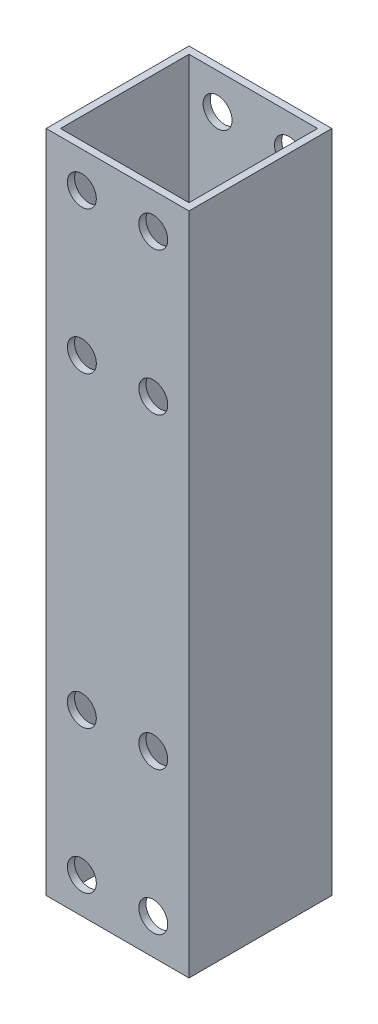
ISO-10303-21;
HEADER;
FILE_DESCRIPTION(('STEP AP214'),'2;1');
FILE_NAME('part.step','',(''),(''),'','','');
FILE_SCHEMA(('AUTOMOTIVE_DESIGN { 1 0 10303 214 1 1 1 1 }'));
ENDSEC;
DATA;
#1=APPLICATION_CONTEXT('core data for automotive mechanical design processes');
#2=APPLICATION_PROTOCOL_DEFINITION('international standard','automotive_design',2000,#1);
#3=PRODUCT_CONTEXT('',#1,'mechanical');
#4=PRODUCT('Part','Part','',(#3));
#5=PRODUCT_RELATED_PRODUCT_CATEGORY('part','',(#4));
#6=PRODUCT_DEFINITION_FORMATION('','',#4);
#7=PRODUCT_DEFINITION_CONTEXT('part definition',#1,'design');
#8=PRODUCT_DEFINITION('design','',#6,#7);
#9=PRODUCT_DEFINITION_SHAPE('','',#8);
#10=(LENGTH_UNIT() NAMED_UNIT(*) SI_UNIT(.MILLI.,.METRE.));
#11=(NAMED_UNIT(*) PLANE_ANGLE_UNIT() SI_UNIT($,.RADIAN.));
#12=(NAMED_UNIT(*) SI_UNIT($,.STERADIAN.) SOLID_ANGLE_UNIT());
#13=UNCERTAINTY_MEASURE_WITH_UNIT(LENGTH_MEASURE(1.E-05),#10,'distance_accuracy_value','');
#14=(GEOMETRIC_REPRESENTATION_CONTEXT(3) GLOBAL_UNCERTAINTY_ASSIGNED_CONTEXT((#13)) GLOBAL_UNIT_ASSIGNED_CONTEXT((#10,
#11,#12)) REPRESENTATION_CONTEXT('',''));
#15=CARTESIAN_POINT('',(0.,0.,0.));
#16=DIRECTION('',(0.,0.,1.));
#17=DIRECTION('',(1.,0.,0.));
#18=AXIS2_PLACEMENT_3D('',#15,#16,#17);
#19=CARTESIAN_POINT('',(0.,93.,0.));
#20=DIRECTION('',(0.,1.,0.));
#21=DIRECTION('',(0.,0.,1.));
#22=AXIS2_PLACEMENT_3D('',#19,#20,#21);
#23=PLANE('',#22);
#24=DIRECTION('',(0.,0.,-1.));
#25=VECTOR('',#24,1.);
#26=CARTESIAN_POINT('',(10.,93.,-10.));
#27=LINE('',#26,#25);
#28=CARTESIAN_POINT('',(10.,93.,10.));
#29=VERTEX_POINT('',#28);
#30=CARTESIAN_POINT('',(10.,93.,-10.));
#31=VERTEX_POINT('',#30);
#32=EDGE_CURVE('E139',#29,#31,#27,.T.);
#33=ORIENTED_EDGE('',*,*,#32,.T.);
#34=DIRECTION('',(-1.,0.,0.));
#35=VECTOR('',#34,1.);
#36=CARTESIAN_POINT('',(-10.,93.,-10.));
#37=LINE('',#36,#35);
#38=CARTESIAN_POINT('',(-10.,93.,-10.));
#39=VERTEX_POINT('',#38);
#40=EDGE_CURVE('E142',#31,#39,#37,.T.);
#41=ORIENTED_EDGE('',*,*,#40,.T.);
#42=DIRECTION('',(0.,0.,1.));
#43=VECTOR('',#42,1.);
#44=CARTESIAN_POINT('',(-10.,93.,-10.));
#45=LINE('',#44,#43);
#46=CARTESIAN_POINT('',(-10.,93.,10.));
#47=VERTEX_POINT('',#46);
#48=EDGE_CURVE('E145',#39,#47,#45,.T.);
#49=ORIENTED_EDGE('',*,*,#48,.T.);
#50=DIRECTION('',(1.,0.,0.));
#51=VECTOR('',#50,1.);
#52=CARTESIAN_POINT('',(-10.,93.,10.));
#53=LINE('',#52,#51);
#54=EDGE_CURVE('E147',#47,#29,#53,.T.);
#55=ORIENTED_EDGE('',*,*,#54,.T.);
#56=EDGE_LOOP('',(#33,#41,#49,#55));
#57=FACE_BOUND('',#56,.T.);
#58=DIRECTION('',(1.,0.,0.));
#59=VECTOR('',#58,1.);
#60=CARTESIAN_POINT('',(-9.,93.,9.));
#61=LINE('',#60,#59);
#62=CARTESIAN_POINT('',(-9.,93.,9.));
#63=VERTEX_POINT('',#62);
#64=CARTESIAN_POINT('',(9.00000000000001,93.,9.));
#65=VERTEX_POINT('',#64);
#66=EDGE_CURVE('E109',#63,#65,#61,.T.);
#67=ORIENTED_EDGE('',*,*,#66,.F.);
#68=DIRECTION('',(0.,0.,1.));
#69=VECTOR('',#68,1.);
#70=CARTESIAN_POINT('',(-9.00000000000001,93.,-9.));
#71=LINE('',#70,#69);
#72=CARTESIAN_POINT('',(-9.00000000000001,93.,-9.));
#73=VERTEX_POINT('',#72);
#74=EDGE_CURVE('E101',#73,#63,#71,.T.);
#75=ORIENTED_EDGE('',*,*,#74,.F.);
#76=DIRECTION('',(-1.,0.,0.));
#77=VECTOR('',#76,1.);
#78=CARTESIAN_POINT('',(-9.00000000000001,93.,-9.));
#79=LINE('',#78,#77);
#80=CARTESIAN_POINT('',(9.00000000000001,93.,-9.));
#81=VERTEX_POINT('',#80);
#82=EDGE_CURVE('E123',#81,#73,#79,.T.);
#83=ORIENTED_EDGE('',*,*,#82,.F.);
#84=DIRECTION('',(0.,0.,-1.));
#85=VECTOR('',#84,1.);
#86=CARTESIAN_POINT('',(9.00000000000001,93.,-9.));
#87=LINE('',#86,#85);
#88=EDGE_CURVE('E121',#65,#81,#87,.T.);
#89=ORIENTED_EDGE('',*,*,#88,.F.);
#90=EDGE_LOOP('',(#67,#75,#83,#89));
#91=FACE_BOUND('',#90,.T.);
#92=ADVANCED_FACE('F34',(#57,#91),#23,.T.);
#93=CARTESIAN_POINT('',(0.,0.,0.));
#94=DIRECTION('',(0.,1.,0.));
#95=DIRECTION('',(0.,0.,1.));
#96=AXIS2_PLACEMENT_3D('',#93,#94,#95);
#97=PLANE('',#96);
#98=DIRECTION('',(0.,0.,-1.));
#99=VECTOR('',#98,1.);
#100=CARTESIAN_POINT('',(10.,0.,-10.));
#101=LINE('',#100,#99);
#102=CARTESIAN_POINT('',(10.,0.,10.));
#103=VERTEX_POINT('',#102);
#104=CARTESIAN_POINT('',(10.,0.,-10.));
#105=VERTEX_POINT('',#104);
#106=EDGE_CURVE('E117',#103,#105,#101,.T.);
#107=ORIENTED_EDGE('',*,*,#106,.F.);
#108=DIRECTION('',(1.,0.,0.));
#109=VECTOR('',#108,1.);
#110=CARTESIAN_POINT('',(-10.,0.,10.));
#111=LINE('',#110,#109);
#112=CARTESIAN_POINT('',(-10.,0.,10.));
#113=VERTEX_POINT('',#112);
#114=EDGE_CURVE('E143',#113,#103,#111,.T.);
#115=ORIENTED_EDGE('',*,*,#114,.F.);
#116=DIRECTION('',(0.,0.,1.));
#117=VECTOR('',#116,1.);
#118=CARTESIAN_POINT('',(-10.,0.,-10.));
#119=LINE('',#118,#117);
#120=CARTESIAN_POINT('',(-10.,0.,-10.));
#121=VERTEX_POINT('',#120);
#122=EDGE_CURVE('E154',#121,#113,#119,.T.);
#123=ORIENTED_EDGE('',*,*,#122,.F.);
#124=DIRECTION('',(-1.,0.,0.));
#125=VECTOR('',#124,1.);
#126=CARTESIAN_POINT('',(-10.,0.,-10.));
#127=LINE('',#126,#125);
#128=EDGE_CURVE('E152',#105,#121,#127,.T.);
#129=ORIENTED_EDGE('',*,*,#128,.F.);
#130=EDGE_LOOP('',(#107,#115,#123,#129));
#131=FACE_BOUND('',#130,.T.);
#132=DIRECTION('',(0.,0.,1.));
#133=VECTOR('',#132,1.);
#134=CARTESIAN_POINT('',(-9.00000000000001,0.,-9.));
#135=LINE('',#134,#133);
#136=CARTESIAN_POINT('',(-9.00000000000001,0.,-9.));
#137=VERTEX_POINT('',#136);
#138=CARTESIAN_POINT('',(-9.,0.,9.));
#139=VERTEX_POINT('',#138);
#140=EDGE_CURVE('E59',#137,#139,#135,.T.);
#141=ORIENTED_EDGE('',*,*,#140,.T.);
#142=DIRECTION('',(1.,0.,0.));
#143=VECTOR('',#142,1.);
#144=CARTESIAN_POINT('',(-9.,0.,9.));
#145=LINE('',#144,#143);
#146=CARTESIAN_POINT('',(9.00000000000001,0.,9.));
#147=VERTEX_POINT('',#146);
#148=EDGE_CURVE('E116',#139,#147,#145,.T.);
#149=ORIENTED_EDGE('',*,*,#148,.T.);
#150=DIRECTION('',(0.,0.,-1.));
#151=VECTOR('',#150,1.);
#152=CARTESIAN_POINT('',(9.00000000000001,0.,-9.));
#153=LINE('',#152,#151);
#154=CARTESIAN_POINT('',(9.00000000000001,0.,-9.));
#155=VERTEX_POINT('',#154);
#156=EDGE_CURVE('E131',#147,#155,#153,.T.);
#157=ORIENTED_EDGE('',*,*,#156,.T.);
#158=DIRECTION('',(-1.,0.,0.));
#159=VECTOR('',#158,1.);
#160=CARTESIAN_POINT('',(-9.00000000000001,0.,-9.));
#161=LINE('',#160,#159);
#162=EDGE_CURVE('E110',#155,#137,#161,.T.);
#163=ORIENTED_EDGE('',*,*,#162,.T.);
#164=EDGE_LOOP('',(#141,#149,#157,#163));
#165=FACE_BOUND('',#164,.T.);
#166=ADVANCED_FACE('F230',(#131,#165),#97,.F.);
#167=CARTESIAN_POINT('',(10.,93.,-10.));
#168=DIRECTION('',(-1.,0.,0.));
#169=DIRECTION('',(0.,0.,1.));
#170=AXIS2_PLACEMENT_3D('',#167,#168,#169);
#171=PLANE('',#170);
#172=ORIENTED_EDGE('',*,*,#106,.T.);
#173=DIRECTION('',(0.,-1.,0.));
#174=VECTOR('',#173,1.);
#175=CARTESIAN_POINT('',(10.,93.,-10.));
#176=LINE('',#175,#174);
#177=EDGE_CURVE('E11',#31,#105,#176,.T.);
#178=ORIENTED_EDGE('',*,*,#177,.F.);
#179=ORIENTED_EDGE('',*,*,#32,.F.);
#180=DIRECTION('',(0.,-1.,0.));
#181=VECTOR('',#180,1.);
#182=CARTESIAN_POINT('',(10.,93.,10.));
#183=LINE('',#182,#181);
#184=EDGE_CURVE('E149',#29,#103,#183,.T.);
#185=ORIENTED_EDGE('',*,*,#184,.T.);
#186=EDGE_LOOP('',(#172,#178,#179,#185));
#187=FACE_BOUND('',#186,.T.);
#188=ADVANCED_FACE('F36',(#187),#171,.F.);
#189=CARTESIAN_POINT('',(-10.,93.,-10.));
#190=DIRECTION('',(0.,0.,1.));
#191=DIRECTION('',(1.,0.,0.));
#192=AXIS2_PLACEMENT_3D('',#189,#190,#191);
#193=PLANE('',#192);
#194=CARTESIAN_POINT('',(5.,88.,-10.));
#195=DIRECTION('',(0.,0.,1.));
#196=DIRECTION('',(1.,0.,0.));
#197=AXIS2_PLACEMENT_3D('',#194,#195,#196);
#198=CIRCLE('',#197,2.025);
#199=CARTESIAN_POINT('',(7.025,88.,-10.));
#200=VERTEX_POINT('',#199);
#201=EDGE_CURVE('E266',#200,#200,#198,.T.);
#202=ORIENTED_EDGE('',*,*,#201,.T.);
#203=EDGE_LOOP('',(#202));
#204=FACE_BOUND('',#203,.T.);
#205=CARTESIAN_POINT('',(5.,4.99999999999999,-10.));
#206=DIRECTION('',(0.,0.,1.));
#207=DIRECTION('',(1.,0.,0.));
#208=AXIS2_PLACEMENT_3D('',#205,#206,#207);
#209=CIRCLE('',#208,2.025);
#210=CARTESIAN_POINT('',(7.025,4.99999999999999,-10.));
#211=VERTEX_POINT('',#210);
#212=EDGE_CURVE('E270',#211,#211,#209,.T.);
#213=ORIENTED_EDGE('',*,*,#212,.T.);
#214=EDGE_LOOP('',(#213));
#215=FACE_BOUND('',#214,.T.);
#216=CARTESIAN_POINT('',(5.,25.,-10.));
#217=DIRECTION('',(0.,0.,1.));
#218=DIRECTION('',(1.,0.,0.));
#219=AXIS2_PLACEMENT_3D('',#216,#217,#218);
#220=CIRCLE('',#219,2.025);
#221=CARTESIAN_POINT('',(7.025,25.,-10.));
#222=VERTEX_POINT('',#221);
#223=EDGE_CURVE('E274',#222,#222,#220,.T.);
#224=ORIENTED_EDGE('',*,*,#223,.T.);
#225=EDGE_LOOP('',(#224));
#226=FACE_BOUND('',#225,.T.);
#227=CARTESIAN_POINT('',(-5.,25.,-10.));
#228=DIRECTION('',(0.,0.,1.));
#229=DIRECTION('',(1.,0.,0.));
#230=AXIS2_PLACEMENT_3D('',#227,#228,#229);
#231=CIRCLE('',#230,2.025);
#232=CARTESIAN_POINT('',(-2.975,25.,-10.));
#233=VERTEX_POINT('',#232);
#234=EDGE_CURVE('E278',#233,#233,#231,.T.);
#235=ORIENTED_EDGE('',*,*,#234,.T.);
#236=EDGE_LOOP('',(#235));
#237=FACE_BOUND('',#236,.T.);
#238=CARTESIAN_POINT('',(5.,68.,-10.));
#239=DIRECTION('',(0.,0.,1.));
#240=DIRECTION('',(1.,0.,0.));
#241=AXIS2_PLACEMENT_3D('',#238,#239,#240);
#242=CIRCLE('',#241,2.025);
#243=CARTESIAN_POINT('',(7.025,68.,-10.));
#244=VERTEX_POINT('',#243);
#245=EDGE_CURVE('E282',#244,#244,#242,.T.);
#246=ORIENTED_EDGE('',*,*,#245,.T.);
#247=EDGE_LOOP('',(#246));
#248=FACE_BOUND('',#247,.T.);
#249=CARTESIAN_POINT('',(-5.,68.,-10.));
#250=DIRECTION('',(0.,0.,1.));
#251=DIRECTION('',(1.,0.,0.));
#252=AXIS2_PLACEMENT_3D('',#249,#250,#251);
#253=CIRCLE('',#252,2.025);
#254=CARTESIAN_POINT('',(-2.975,68.,-10.));
#255=VERTEX_POINT('',#254);
#256=EDGE_CURVE('E286',#255,#255,#253,.T.);
#257=ORIENTED_EDGE('',*,*,#256,.T.);
#258=EDGE_LOOP('',(#257));
#259=FACE_BOUND('',#258,.T.);
#260=CARTESIAN_POINT('',(-5.,88.,-10.));
#261=DIRECTION('',(0.,0.,1.));
#262=DIRECTION('',(1.,0.,0.));
#263=AXIS2_PLACEMENT_3D('',#260,#261,#262);
#264=CIRCLE('',#263,2.025);
#265=CARTESIAN_POINT('',(-2.975,88.,-10.));
#266=VERTEX_POINT('',#265);
#267=EDGE_CURVE('E290',#266,#266,#264,.T.);
#268=ORIENTED_EDGE('',*,*,#267,.T.);
#269=EDGE_LOOP('',(#268));
#270=FACE_BOUND('',#269,.T.);
#271=CARTESIAN_POINT('',(-5.,5.,-10.));
#272=DIRECTION('',(0.,0.,1.));
#273=DIRECTION('',(1.,0.,0.));
#274=AXIS2_PLACEMENT_3D('',#271,#272,#273);
#275=CIRCLE('',#274,2.025);
#276=CARTESIAN_POINT('',(-2.975,5.,-10.));
#277=VERTEX_POINT('',#276);
#278=EDGE_CURVE('E168',#277,#277,#275,.T.);
#279=ORIENTED_EDGE('',*,*,#278,.T.);
#280=EDGE_LOOP('',(#279));
#281=FACE_BOUND('',#280,.T.);
#282=ORIENTED_EDGE('',*,*,#128,.T.);
#283=DIRECTION('',(0.,-1.,0.));
#284=VECTOR('',#283,1.);
#285=CARTESIAN_POINT('',(-10.,93.,-10.));
#286=LINE('',#285,#284);
#287=EDGE_CURVE('E43',#39,#121,#286,.T.);
#288=ORIENTED_EDGE('',*,*,#287,.F.);
#289=ORIENTED_EDGE('',*,*,#40,.F.);
#290=ORIENTED_EDGE('',*,*,#177,.T.);
#291=EDGE_LOOP('',(#282,#288,#289,#290));
#292=FACE_BOUND('',#291,.T.);
#293=ADVANCED_FACE('F255',(#204,#215,#226,#237,#248,#259,#270,#281,#292),#193,.F.);
#294=CARTESIAN_POINT('',(-10.,93.,-10.));
#295=DIRECTION('',(1.,0.,0.));
#296=DIRECTION('',(0.,0.,-1.));
#297=AXIS2_PLACEMENT_3D('',#294,#295,#296);
#298=PLANE('',#297);
#299=ORIENTED_EDGE('',*,*,#122,.T.);
#300=DIRECTION('',(0.,-1.,0.));
#301=VECTOR('',#300,1.);
#302=CARTESIAN_POINT('',(-10.,93.,10.));
#303=LINE('',#302,#301);
#304=EDGE_CURVE('E159',#47,#113,#303,.T.);
#305=ORIENTED_EDGE('',*,*,#304,.F.);
#306=ORIENTED_EDGE('',*,*,#48,.F.);
#307=ORIENTED_EDGE('',*,*,#287,.T.);
#308=EDGE_LOOP('',(#299,#305,#306,#307));
#309=FACE_BOUND('',#308,.T.);
#310=ADVANCED_FACE('F252',(#309),#298,.F.);
#311=CARTESIAN_POINT('',(-10.,93.,10.));
#312=DIRECTION('',(0.,0.,-1.));
#313=DIRECTION('',(-1.,0.,0.));
#314=AXIS2_PLACEMENT_3D('',#311,#312,#313);
#315=PLANE('',#314);
#316=CARTESIAN_POINT('',(5.,88.,10.));
#317=DIRECTION('',(0.,0.,1.));
#318=DIRECTION('',(1.,0.,0.));
#319=AXIS2_PLACEMENT_3D('',#316,#317,#318);
#320=CIRCLE('',#319,2.025);
#321=CARTESIAN_POINT('',(7.025,88.,10.));
#322=VERTEX_POINT('',#321);
#323=EDGE_CURVE('E402',#322,#322,#320,.T.);
#324=ORIENTED_EDGE('',*,*,#323,.F.);
#325=EDGE_LOOP('',(#324));
#326=FACE_BOUND('',#325,.T.);
#327=CARTESIAN_POINT('',(5.,4.99999999999999,10.));
#328=DIRECTION('',(0.,0.,1.));
#329=DIRECTION('',(1.,0.,0.));
#330=AXIS2_PLACEMENT_3D('',#327,#328,#329);
#331=CIRCLE('',#330,2.025);
#332=CARTESIAN_POINT('',(7.025,4.99999999999999,10.));
#333=VERTEX_POINT('',#332);
#334=EDGE_CURVE('E393',#333,#333,#331,.T.);
#335=ORIENTED_EDGE('',*,*,#334,.F.);
#336=EDGE_LOOP('',(#335));
#337=FACE_BOUND('',#336,.T.);
#338=CARTESIAN_POINT('',(5.,25.,10.));
#339=DIRECTION('',(0.,0.,1.));
#340=DIRECTION('',(1.,0.,0.));
#341=AXIS2_PLACEMENT_3D('',#338,#339,#340);
#342=CIRCLE('',#341,2.025);
#343=CARTESIAN_POINT('',(7.025,25.,10.));
#344=VERTEX_POINT('',#343);
#345=EDGE_CURVE('E311',#344,#344,#342,.T.);
#346=ORIENTED_EDGE('',*,*,#345,.F.);
#347=EDGE_LOOP('',(#346));
#348=FACE_BOUND('',#347,.T.);
#349=CARTESIAN_POINT('',(-5.,25.,10.));
#350=DIRECTION('',(0.,0.,1.));
#351=DIRECTION('',(1.,0.,0.));
#352=AXIS2_PLACEMENT_3D('',#349,#350,#351);
#353=CIRCLE('',#352,2.025);
#354=CARTESIAN_POINT('',(-2.975,25.,10.));
#355=VERTEX_POINT('',#354);
#356=EDGE_CURVE('E392',#355,#355,#353,.T.);
#357=ORIENTED_EDGE('',*,*,#356,.F.);
#358=EDGE_LOOP('',(#357));
#359=FACE_BOUND('',#358,.T.);
#360=CARTESIAN_POINT('',(5.,68.,10.));
#361=DIRECTION('',(0.,0.,1.));
#362=DIRECTION('',(1.,0.,0.));
#363=AXIS2_PLACEMENT_3D('',#360,#361,#362);
#364=CIRCLE('',#363,2.025);
#365=CARTESIAN_POINT('',(7.025,68.,10.));
#366=VERTEX_POINT('',#365);
#367=EDGE_CURVE('E414',#366,#366,#364,.T.);
#368=ORIENTED_EDGE('',*,*,#367,.F.);
#369=EDGE_LOOP('',(#368));
#370=FACE_BOUND('',#369,.T.);
#371=CARTESIAN_POINT('',(-5.,68.,10.));
#372=DIRECTION('',(0.,0.,1.));
#373=DIRECTION('',(1.,0.,0.));
#374=AXIS2_PLACEMENT_3D('',#371,#372,#373);
#375=CIRCLE('',#374,2.025);
#376=CARTESIAN_POINT('',(-2.975,68.,10.));
#377=VERTEX_POINT('',#376);
#378=EDGE_CURVE('E418',#377,#377,#375,.T.);
#379=ORIENTED_EDGE('',*,*,#378,.F.);
#380=EDGE_LOOP('',(#379));
#381=FACE_BOUND('',#380,.T.);
#382=CARTESIAN_POINT('',(-5.,88.,10.));
#383=DIRECTION('',(0.,0.,1.));
#384=DIRECTION('',(1.,0.,0.));
#385=AXIS2_PLACEMENT_3D('',#382,#383,#384);
#386=CIRCLE('',#385,2.025);
#387=CARTESIAN_POINT('',(-2.975,88.,10.));
#388=VERTEX_POINT('',#387);
#389=EDGE_CURVE('E398',#388,#388,#386,.T.);
#390=ORIENTED_EDGE('',*,*,#389,.F.);
#391=EDGE_LOOP('',(#390));
#392=FACE_BOUND('',#391,.T.);
#393=CARTESIAN_POINT('',(-5.,5.,10.));
#394=DIRECTION('',(0.,0.,1.));
#395=DIRECTION('',(1.,0.,0.));
#396=AXIS2_PLACEMENT_3D('',#393,#394,#395);
#397=CIRCLE('',#396,2.025);
#398=CARTESIAN_POINT('',(-2.975,5.,10.));
#399=VERTEX_POINT('',#398);
#400=EDGE_CURVE('E306',#399,#399,#397,.T.);
#401=ORIENTED_EDGE('',*,*,#400,.F.);
#402=EDGE_LOOP('',(#401));
#403=FACE_BOUND('',#402,.T.);
#404=ORIENTED_EDGE('',*,*,#114,.T.);
#405=ORIENTED_EDGE('',*,*,#184,.F.);
#406=ORIENTED_EDGE('',*,*,#54,.F.);
#407=ORIENTED_EDGE('',*,*,#304,.T.);
#408=EDGE_LOOP('',(#404,#405,#406,#407));
#409=FACE_BOUND('',#408,.T.);
#410=ADVANCED_FACE('F249',(#326,#337,#348,#359,#370,#381,#392,#403,#409),#315,.F.);
#411=CARTESIAN_POINT('',(-9.00000000000001,93.,-9.));
#412=DIRECTION('',(1.,0.,0.));
#413=DIRECTION('',(0.,0.,-1.));
#414=AXIS2_PLACEMENT_3D('',#411,#412,#413);
#415=PLANE('',#414);
#416=ORIENTED_EDGE('',*,*,#140,.F.);
#417=DIRECTION('',(0.,-1.,0.));
#418=VECTOR('',#417,1.);
#419=CARTESIAN_POINT('',(-9.00000000000001,93.,-9.));
#420=LINE('',#419,#418);
#421=EDGE_CURVE('E105',#73,#137,#420,.T.);
#422=ORIENTED_EDGE('',*,*,#421,.F.);
#423=ORIENTED_EDGE('',*,*,#74,.T.);
#424=DIRECTION('',(0.,-1.,0.));
#425=VECTOR('',#424,1.);
#426=CARTESIAN_POINT('',(-9.,93.,9.));
#427=LINE('',#426,#425);
#428=EDGE_CURVE('E104',#63,#139,#427,.T.);
#429=ORIENTED_EDGE('',*,*,#428,.T.);
#430=EDGE_LOOP('',(#416,#422,#423,#429));
#431=FACE_BOUND('',#430,.T.);
#432=ADVANCED_FACE('F103',(#431),#415,.T.);
#433=CARTESIAN_POINT('',(-9.,93.,9.));
#434=DIRECTION('',(0.,0.,-1.));
#435=DIRECTION('',(-1.,0.,0.));
#436=AXIS2_PLACEMENT_3D('',#433,#434,#435);
#437=PLANE('',#436);
#438=CARTESIAN_POINT('',(5.,88.,9.));
#439=DIRECTION('',(0.,0.,-1.));
#440=DIRECTION('',(-1.,0.,0.));
#441=AXIS2_PLACEMENT_3D('',#438,#439,#440);
#442=CIRCLE('',#441,2.025);
#443=CARTESIAN_POINT('',(2.975,88.,9.));
#444=VERTEX_POINT('',#443);
#445=EDGE_CURVE('E129',#444,#444,#442,.T.);
#446=ORIENTED_EDGE('',*,*,#445,.F.);
#447=EDGE_LOOP('',(#446));
#448=FACE_BOUND('',#447,.T.);
#449=CARTESIAN_POINT('',(5.,4.99999999999999,9.));
#450=DIRECTION('',(0.,0.,-1.));
#451=DIRECTION('',(-1.,0.,0.));
#452=AXIS2_PLACEMENT_3D('',#449,#450,#451);
#453=CIRCLE('',#452,2.025);
#454=CARTESIAN_POINT('',(2.975,4.99999999999999,9.));
#455=VERTEX_POINT('',#454);
#456=EDGE_CURVE('E190',#455,#455,#453,.T.);
#457=ORIENTED_EDGE('',*,*,#456,.F.);
#458=EDGE_LOOP('',(#457));
#459=FACE_BOUND('',#458,.T.);
#460=CARTESIAN_POINT('',(5.,25.,9.));
#461=DIRECTION('',(0.,0.,-1.));
#462=DIRECTION('',(-1.,0.,0.));
#463=AXIS2_PLACEMENT_3D('',#460,#461,#462);
#464=CIRCLE('',#463,2.025);
#465=CARTESIAN_POINT('',(2.975,25.,9.));
#466=VERTEX_POINT('',#465);
#467=EDGE_CURVE('E187',#466,#466,#464,.T.);
#468=ORIENTED_EDGE('',*,*,#467,.F.);
#469=EDGE_LOOP('',(#468));
#470=FACE_BOUND('',#469,.T.);
#471=CARTESIAN_POINT('',(-5.,25.,9.));
#472=DIRECTION('',(0.,0.,-1.));
#473=DIRECTION('',(-1.,0.,0.));
#474=AXIS2_PLACEMENT_3D('',#471,#472,#473);
#475=CIRCLE('',#474,2.025);
#476=CARTESIAN_POINT('',(-7.025,25.,9.));
#477=VERTEX_POINT('',#476);
#478=EDGE_CURVE('E184',#477,#477,#475,.T.);
#479=ORIENTED_EDGE('',*,*,#478,.F.);
#480=EDGE_LOOP('',(#479));
#481=FACE_BOUND('',#480,.T.);
#482=CARTESIAN_POINT('',(5.,68.,9.));
#483=DIRECTION('',(0.,0.,-1.));
#484=DIRECTION('',(-1.,0.,0.));
#485=AXIS2_PLACEMENT_3D('',#482,#483,#484);
#486=CIRCLE('',#485,2.025);
#487=CARTESIAN_POINT('',(2.975,68.,9.));
#488=VERTEX_POINT('',#487);
#489=EDGE_CURVE('E180',#488,#488,#486,.T.);
#490=ORIENTED_EDGE('',*,*,#489,.F.);
#491=EDGE_LOOP('',(#490));
#492=FACE_BOUND('',#491,.T.);
#493=CARTESIAN_POINT('',(-5.,68.,9.));
#494=DIRECTION('',(0.,0.,-1.));
#495=DIRECTION('',(-1.,0.,0.));
#496=AXIS2_PLACEMENT_3D('',#493,#494,#495);
#497=CIRCLE('',#496,2.025);
#498=CARTESIAN_POINT('',(-7.025,68.,9.));
#499=VERTEX_POINT('',#498);
#500=EDGE_CURVE('E176',#499,#499,#497,.T.);
#501=ORIENTED_EDGE('',*,*,#500,.F.);
#502=EDGE_LOOP('',(#501));
#503=FACE_BOUND('',#502,.T.);
#504=CARTESIAN_POINT('',(-5.,88.,9.));
#505=DIRECTION('',(0.,0.,-1.));
#506=DIRECTION('',(-1.,0.,0.));
#507=AXIS2_PLACEMENT_3D('',#504,#505,#506);
#508=CIRCLE('',#507,2.025);
#509=CARTESIAN_POINT('',(-7.025,88.,9.));
#510=VERTEX_POINT('',#509);
#511=EDGE_CURVE('E172',#510,#510,#508,.T.);
#512=ORIENTED_EDGE('',*,*,#511,.F.);
#513=EDGE_LOOP('',(#512));
#514=FACE_BOUND('',#513,.T.);
#515=CARTESIAN_POINT('',(-5.,5.,9.));
#516=DIRECTION('',(0.,0.,-1.));
#517=DIRECTION('',(-1.,0.,0.));
#518=AXIS2_PLACEMENT_3D('',#515,#516,#517);
#519=CIRCLE('',#518,2.025);
#520=CARTESIAN_POINT('',(-7.025,5.,9.));
#521=VERTEX_POINT('',#520);
#522=EDGE_CURVE('E167',#521,#521,#519,.T.);
#523=ORIENTED_EDGE('',*,*,#522,.F.);
#524=EDGE_LOOP('',(#523));
#525=FACE_BOUND('',#524,.T.);
#526=ORIENTED_EDGE('',*,*,#148,.F.);
#527=ORIENTED_EDGE('',*,*,#428,.F.);
#528=ORIENTED_EDGE('',*,*,#66,.T.);
#529=DIRECTION('',(0.,-1.,0.));
#530=VECTOR('',#529,1.);
#531=CARTESIAN_POINT('',(9.00000000000001,93.,9.));
#532=LINE('',#531,#530);
#533=EDGE_CURVE('E118',#65,#147,#532,.T.);
#534=ORIENTED_EDGE('',*,*,#533,.T.);
#535=EDGE_LOOP('',(#526,#527,#528,#534));
#536=FACE_BOUND('',#535,.T.);
#537=ADVANCED_FACE('F113',(#448,#459,#470,#481,#492,#503,#514,#525,#536),#437,.T.);
#538=CARTESIAN_POINT('',(9.00000000000001,93.,-9.));
#539=DIRECTION('',(-1.,0.,0.));
#540=DIRECTION('',(0.,0.,1.));
#541=AXIS2_PLACEMENT_3D('',#538,#539,#540);
#542=PLANE('',#541);
#543=ORIENTED_EDGE('',*,*,#156,.F.);
#544=ORIENTED_EDGE('',*,*,#533,.F.);
#545=ORIENTED_EDGE('',*,*,#88,.T.);
#546=DIRECTION('',(0.,-1.,0.));
#547=VECTOR('',#546,1.);
#548=CARTESIAN_POINT('',(9.00000000000001,93.,-9.));
#549=LINE('',#548,#547);
#550=EDGE_CURVE('E51',#81,#155,#549,.T.);
#551=ORIENTED_EDGE('',*,*,#550,.T.);
#552=EDGE_LOOP('',(#543,#544,#545,#551));
#553=FACE_BOUND('',#552,.T.);
#554=ADVANCED_FACE('F214',(#553),#542,.T.);
#555=CARTESIAN_POINT('',(-9.00000000000001,93.,-9.));
#556=DIRECTION('',(0.,0.,1.));
#557=DIRECTION('',(1.,0.,0.));
#558=AXIS2_PLACEMENT_3D('',#555,#556,#557);
#559=PLANE('',#558);
#560=CARTESIAN_POINT('',(5.,88.,-9.));
#561=DIRECTION('',(0.,0.,1.));
#562=DIRECTION('',(1.,0.,0.));
#563=AXIS2_PLACEMENT_3D('',#560,#561,#562);
#564=CIRCLE('',#563,2.025);
#565=CARTESIAN_POINT('',(7.025,88.,-9.));
#566=VERTEX_POINT('',#565);
#567=EDGE_CURVE('E38',#566,#566,#564,.T.);
#568=ORIENTED_EDGE('',*,*,#567,.F.);
#569=EDGE_LOOP('',(#568));
#570=FACE_BOUND('',#569,.T.);
#571=CARTESIAN_POINT('',(5.,4.99999999999999,-9.));
#572=DIRECTION('',(0.,0.,1.));
#573=DIRECTION('',(1.,0.,0.));
#574=AXIS2_PLACEMENT_3D('',#571,#572,#573);
#575=CIRCLE('',#574,2.025);
#576=CARTESIAN_POINT('',(7.025,4.99999999999999,-9.));
#577=VERTEX_POINT('',#576);
#578=EDGE_CURVE('E188',#577,#577,#575,.T.);
#579=ORIENTED_EDGE('',*,*,#578,.F.);
#580=EDGE_LOOP('',(#579));
#581=FACE_BOUND('',#580,.T.);
#582=CARTESIAN_POINT('',(5.,25.,-9.));
#583=DIRECTION('',(0.,0.,1.));
#584=DIRECTION('',(1.,0.,0.));
#585=AXIS2_PLACEMENT_3D('',#582,#583,#584);
#586=CIRCLE('',#585,2.025);
#587=CARTESIAN_POINT('',(7.025,25.,-9.));
#588=VERTEX_POINT('',#587);
#589=EDGE_CURVE('E185',#588,#588,#586,.T.);
#590=ORIENTED_EDGE('',*,*,#589,.F.);
#591=EDGE_LOOP('',(#590));
#592=FACE_BOUND('',#591,.T.);
#593=CARTESIAN_POINT('',(-5.,25.,-9.));
#594=DIRECTION('',(0.,0.,1.));
#595=DIRECTION('',(1.,0.,0.));
#596=AXIS2_PLACEMENT_3D('',#593,#594,#595);
#597=CIRCLE('',#596,2.025);
#598=CARTESIAN_POINT('',(-2.975,25.,-9.));
#599=VERTEX_POINT('',#598);
#600=EDGE_CURVE('E181',#599,#599,#597,.T.);
#601=ORIENTED_EDGE('',*,*,#600,.F.);
#602=EDGE_LOOP('',(#601));
#603=FACE_BOUND('',#602,.T.);
#604=CARTESIAN_POINT('',(5.,68.,-9.));
#605=DIRECTION('',(0.,0.,1.));
#606=DIRECTION('',(1.,0.,0.));
#607=AXIS2_PLACEMENT_3D('',#604,#605,#606);
#608=CIRCLE('',#607,2.025);
#609=CARTESIAN_POINT('',(7.025,68.,-9.));
#610=VERTEX_POINT('',#609);
#611=EDGE_CURVE('E177',#610,#610,#608,.T.);
#612=ORIENTED_EDGE('',*,*,#611,.F.);
#613=EDGE_LOOP('',(#612));
#614=FACE_BOUND('',#613,.T.);
#615=CARTESIAN_POINT('',(-5.,68.,-9.));
#616=DIRECTION('',(0.,0.,1.));
#617=DIRECTION('',(1.,0.,0.));
#618=AXIS2_PLACEMENT_3D('',#615,#616,#617);
#619=CIRCLE('',#618,2.025);
#620=CARTESIAN_POINT('',(-2.975,68.,-9.));
#621=VERTEX_POINT('',#620);
#622=EDGE_CURVE('E173',#621,#621,#619,.T.);
#623=ORIENTED_EDGE('',*,*,#622,.F.);
#624=EDGE_LOOP('',(#623));
#625=FACE_BOUND('',#624,.T.);
#626=CARTESIAN_POINT('',(-5.,88.,-9.));
#627=DIRECTION('',(0.,0.,1.));
#628=DIRECTION('',(1.,0.,0.));
#629=AXIS2_PLACEMENT_3D('',#626,#627,#628);
#630=CIRCLE('',#629,2.025);
#631=CARTESIAN_POINT('',(-2.975,88.,-9.));
#632=VERTEX_POINT('',#631);
#633=EDGE_CURVE('E169',#632,#632,#630,.T.);
#634=ORIENTED_EDGE('',*,*,#633,.F.);
#635=EDGE_LOOP('',(#634));
#636=FACE_BOUND('',#635,.T.);
#637=CARTESIAN_POINT('',(-5.,5.,-9.));
#638=DIRECTION('',(0.,0.,1.));
#639=DIRECTION('',(1.,0.,0.));
#640=AXIS2_PLACEMENT_3D('',#637,#638,#639);
#641=CIRCLE('',#640,2.025);
#642=CARTESIAN_POINT('',(-2.975,5.,-9.));
#643=VERTEX_POINT('',#642);
#644=EDGE_CURVE('E164',#643,#643,#641,.T.);
#645=ORIENTED_EDGE('',*,*,#644,.F.);
#646=EDGE_LOOP('',(#645));
#647=FACE_BOUND('',#646,.T.);
#648=ORIENTED_EDGE('',*,*,#162,.F.);
#649=ORIENTED_EDGE('',*,*,#550,.F.);
#650=ORIENTED_EDGE('',*,*,#82,.T.);
#651=ORIENTED_EDGE('',*,*,#421,.T.);
#652=EDGE_LOOP('',(#648,#649,#650,#651));
#653=FACE_BOUND('',#652,.T.);
#654=ADVANCED_FACE('F210',(#570,#581,#592,#603,#614,#625,#636,#647,#653),#559,.T.);
#655=CARTESIAN_POINT('',(-5.,5.,-10.));
#656=DIRECTION('',(0.,0.,1.));
#657=DIRECTION('',(1.,0.,0.));
#658=AXIS2_PLACEMENT_3D('',#655,#656,#657);
#659=CYLINDRICAL_SURFACE('',#658,2.025);
#660=ORIENTED_EDGE('',*,*,#644,.T.);
#661=EDGE_LOOP('',(#660));
#662=FACE_BOUND('',#661,.T.);
#663=ORIENTED_EDGE('',*,*,#278,.F.);
#664=EDGE_LOOP('',(#663));
#665=FACE_BOUND('',#664,.T.);
#666=ADVANCED_FACE('F213',(#662,#665),#659,.F.);
#667=CARTESIAN_POINT('',(-5.,88.,-10.));
#668=DIRECTION('',(0.,0.,1.));
#669=DIRECTION('',(1.,0.,0.));
#670=AXIS2_PLACEMENT_3D('',#667,#668,#669);
#671=CYLINDRICAL_SURFACE('',#670,2.025);
#672=ORIENTED_EDGE('',*,*,#633,.T.);
#673=EDGE_LOOP('',(#672));
#674=FACE_BOUND('',#673,.T.);
#675=ORIENTED_EDGE('',*,*,#267,.F.);
#676=EDGE_LOOP('',(#675));
#677=FACE_BOUND('',#676,.T.);
#678=ADVANCED_FACE('F346',(#674,#677),#671,.F.);
#679=CARTESIAN_POINT('',(-5.,68.,-10.));
#680=DIRECTION('',(0.,0.,1.));
#681=DIRECTION('',(1.,0.,0.));
#682=AXIS2_PLACEMENT_3D('',#679,#680,#681);
#683=CYLINDRICAL_SURFACE('',#682,2.025);
#684=ORIENTED_EDGE('',*,*,#622,.T.);
#685=EDGE_LOOP('',(#684));
#686=FACE_BOUND('',#685,.T.);
#687=ORIENTED_EDGE('',*,*,#256,.F.);
#688=EDGE_LOOP('',(#687));
#689=FACE_BOUND('',#688,.T.);
#690=ADVANCED_FACE('F356',(#686,#689),#683,.F.);
#691=CARTESIAN_POINT('',(5.,68.,-10.));
#692=DIRECTION('',(0.,0.,1.));
#693=DIRECTION('',(1.,0.,0.));
#694=AXIS2_PLACEMENT_3D('',#691,#692,#693);
#695=CYLINDRICAL_SURFACE('',#694,2.025);
#696=ORIENTED_EDGE('',*,*,#611,.T.);
#697=EDGE_LOOP('',(#696));
#698=FACE_BOUND('',#697,.T.);
#699=ORIENTED_EDGE('',*,*,#245,.F.);
#700=EDGE_LOOP('',(#699));
#701=FACE_BOUND('',#700,.T.);
#702=ADVANCED_FACE('F361',(#698,#701),#695,.F.);
#703=CARTESIAN_POINT('',(-5.,25.,-10.));
#704=DIRECTION('',(0.,0.,1.));
#705=DIRECTION('',(1.,0.,0.));
#706=AXIS2_PLACEMENT_3D('',#703,#704,#705);
#707=CYLINDRICAL_SURFACE('',#706,2.025);
#708=ORIENTED_EDGE('',*,*,#600,.T.);
#709=EDGE_LOOP('',(#708));
#710=FACE_BOUND('',#709,.T.);
#711=ORIENTED_EDGE('',*,*,#234,.F.);
#712=EDGE_LOOP('',(#711));
#713=FACE_BOUND('',#712,.T.);
#714=ADVANCED_FACE('F371',(#710,#713),#707,.F.);
#715=CARTESIAN_POINT('',(5.,25.,-10.));
#716=DIRECTION('',(0.,0.,1.));
#717=DIRECTION('',(1.,0.,0.));
#718=AXIS2_PLACEMENT_3D('',#715,#716,#717);
#719=CYLINDRICAL_SURFACE('',#718,2.025);
#720=ORIENTED_EDGE('',*,*,#589,.T.);
#721=EDGE_LOOP('',(#720));
#722=FACE_BOUND('',#721,.T.);
#723=ORIENTED_EDGE('',*,*,#223,.F.);
#724=EDGE_LOOP('',(#723));
#725=FACE_BOUND('',#724,.T.);
#726=ADVANCED_FACE('F368',(#722,#725),#719,.F.);
#727=CARTESIAN_POINT('',(5.,4.99999999999999,-10.));
#728=DIRECTION('',(0.,0.,1.));
#729=DIRECTION('',(1.,0.,0.));
#730=AXIS2_PLACEMENT_3D('',#727,#728,#729);
#731=CYLINDRICAL_SURFACE('',#730,2.025);
#732=ORIENTED_EDGE('',*,*,#578,.T.);
#733=EDGE_LOOP('',(#732));
#734=FACE_BOUND('',#733,.T.);
#735=ORIENTED_EDGE('',*,*,#212,.F.);
#736=EDGE_LOOP('',(#735));
#737=FACE_BOUND('',#736,.T.);
#738=ADVANCED_FACE('F347',(#734,#737),#731,.F.);
#739=CARTESIAN_POINT('',(5.,88.,-10.));
#740=DIRECTION('',(0.,0.,1.));
#741=DIRECTION('',(1.,0.,0.));
#742=AXIS2_PLACEMENT_3D('',#739,#740,#741);
#743=CYLINDRICAL_SURFACE('',#742,2.025);
#744=ORIENTED_EDGE('',*,*,#567,.T.);
#745=EDGE_LOOP('',(#744));
#746=FACE_BOUND('',#745,.T.);
#747=ORIENTED_EDGE('',*,*,#201,.F.);
#748=EDGE_LOOP('',(#747));
#749=FACE_BOUND('',#748,.T.);
#750=ADVANCED_FACE('F207',(#746,#749),#743,.F.);
#751=ORIENTED_EDGE('',*,*,#522,.T.);
#752=EDGE_LOOP('',(#751));
#753=FACE_BOUND('',#752,.T.);
#754=ORIENTED_EDGE('',*,*,#400,.T.);
#755=EDGE_LOOP('',(#754));
#756=FACE_BOUND('',#755,.T.);
#757=ADVANCED_FACE('F332',(#753,#756),#659,.F.);
#758=ORIENTED_EDGE('',*,*,#511,.T.);
#759=EDGE_LOOP('',(#758));
#760=FACE_BOUND('',#759,.T.);
#761=ORIENTED_EDGE('',*,*,#389,.T.);
#762=EDGE_LOOP('',(#761));
#763=FACE_BOUND('',#762,.T.);
#764=ADVANCED_FACE('F335',(#760,#763),#671,.F.);
#765=ORIENTED_EDGE('',*,*,#500,.T.);
#766=EDGE_LOOP('',(#765));
#767=FACE_BOUND('',#766,.T.);
#768=ORIENTED_EDGE('',*,*,#378,.T.);
#769=EDGE_LOOP('',(#768));
#770=FACE_BOUND('',#769,.T.);
#771=ADVANCED_FACE('F343',(#767,#770),#683,.F.);
#772=ORIENTED_EDGE('',*,*,#489,.T.);
#773=EDGE_LOOP('',(#772));
#774=FACE_BOUND('',#773,.T.);
#775=ORIENTED_EDGE('',*,*,#367,.T.);
#776=EDGE_LOOP('',(#775));
#777=FACE_BOUND('',#776,.T.);
#778=ADVANCED_FACE('F322',(#774,#777),#695,.F.);
#779=ORIENTED_EDGE('',*,*,#478,.T.);
#780=EDGE_LOOP('',(#779));
#781=FACE_BOUND('',#780,.T.);
#782=ORIENTED_EDGE('',*,*,#356,.T.);
#783=EDGE_LOOP('',(#782));
#784=FACE_BOUND('',#783,.T.);
#785=ADVANCED_FACE('F374',(#781,#784),#707,.F.);
#786=ORIENTED_EDGE('',*,*,#467,.T.);
#787=EDGE_LOOP('',(#786));
#788=FACE_BOUND('',#787,.T.);
#789=ORIENTED_EDGE('',*,*,#345,.T.);
#790=EDGE_LOOP('',(#789));
#791=FACE_BOUND('',#790,.T.);
#792=ADVANCED_FACE('F377',(#788,#791),#719,.F.);
#793=ORIENTED_EDGE('',*,*,#456,.T.);
#794=EDGE_LOOP('',(#793));
#795=FACE_BOUND('',#794,.T.);
#796=ORIENTED_EDGE('',*,*,#334,.T.);
#797=EDGE_LOOP('',(#796));
#798=FACE_BOUND('',#797,.T.);
#799=ADVANCED_FACE('F369',(#795,#798),#731,.F.);
#800=ORIENTED_EDGE('',*,*,#445,.T.);
#801=EDGE_LOOP('',(#800));
#802=FACE_BOUND('',#801,.T.);
#803=ORIENTED_EDGE('',*,*,#323,.T.);
#804=EDGE_LOOP('',(#803));
#805=FACE_BOUND('',#804,.T.);
#806=ADVANCED_FACE('F349',(#802,#805),#743,.F.);
#807=CLOSED_SHELL('',(#92,#166,#188,#293,#310,#410,#432,#537,#554,#654,#666,#678,#690,#702,#714,
#726,#738,#750,#757,#764,#771,#778,#785,#792,#799,#806));
#808=MANIFOLD_SOLID_BREP('B2',#807);
#809=ADVANCED_BREP_SHAPE_REPRESENTATION('',(#18,#808),#14);
#810=SHAPE_DEFINITION_REPRESENTATION(#9,#809);
ENDSEC;
END-ISO-10303-21;
